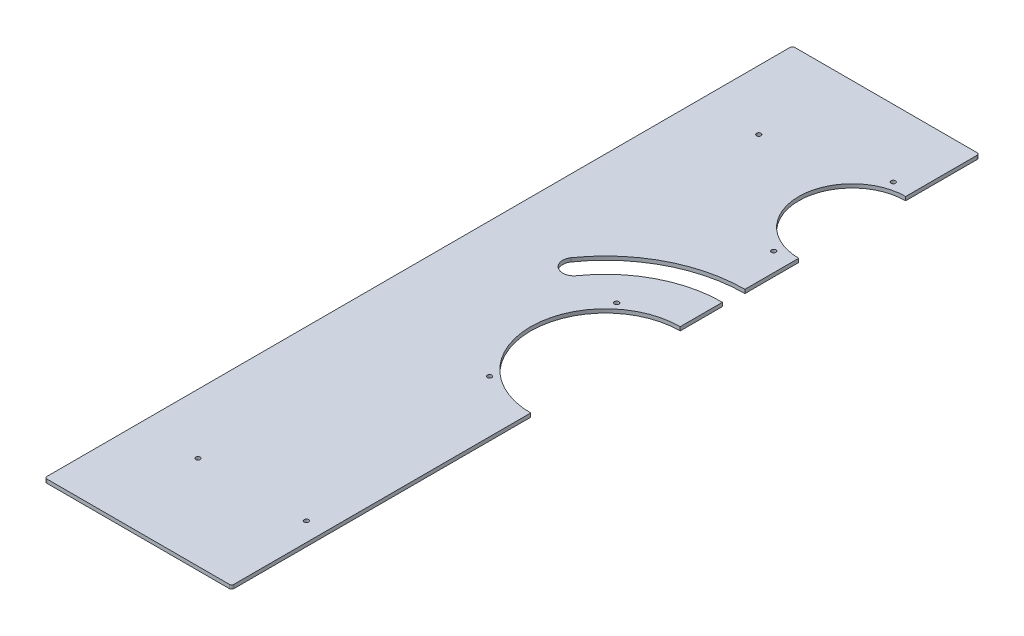
ISO-10303-21;
HEADER;
FILE_DESCRIPTION(('STEP AP214'),'2;1');
FILE_NAME('part.step','',(''),(''),'','','');
FILE_SCHEMA(('AUTOMOTIVE_DESIGN { 1 0 10303 214 1 1 1 1 }'));
ENDSEC;
DATA;
#1=APPLICATION_CONTEXT('core data for automotive mechanical design processes');
#2=APPLICATION_PROTOCOL_DEFINITION('international standard','automotive_design',2000,#1);
#3=PRODUCT_CONTEXT('',#1,'mechanical');
#4=PRODUCT('Part','Part','',(#3));
#5=PRODUCT_RELATED_PRODUCT_CATEGORY('part','',(#4));
#6=PRODUCT_DEFINITION_FORMATION('','',#4);
#7=PRODUCT_DEFINITION_CONTEXT('part definition',#1,'design');
#8=PRODUCT_DEFINITION('design','',#6,#7);
#9=PRODUCT_DEFINITION_SHAPE('','',#8);
#10=(LENGTH_UNIT() NAMED_UNIT(*) SI_UNIT(.MILLI.,.METRE.));
#11=(NAMED_UNIT(*) PLANE_ANGLE_UNIT() SI_UNIT($,.RADIAN.));
#12=(NAMED_UNIT(*) SI_UNIT($,.STERADIAN.) SOLID_ANGLE_UNIT());
#13=UNCERTAINTY_MEASURE_WITH_UNIT(LENGTH_MEASURE(1.E-05),#10,'distance_accuracy_value','');
#14=(GEOMETRIC_REPRESENTATION_CONTEXT(3) GLOBAL_UNCERTAINTY_ASSIGNED_CONTEXT((#13)) GLOBAL_UNIT_ASSIGNED_CONTEXT((#10,
#11,#12)) REPRESENTATION_CONTEXT('',''));
#15=CARTESIAN_POINT('',(0.,0.,0.));
#16=DIRECTION('',(0.,0.,1.));
#17=DIRECTION('',(1.,0.,0.));
#18=AXIS2_PLACEMENT_3D('',#15,#16,#17);
#19=CARTESIAN_POINT('',(125.,5.,500.));
#20=DIRECTION('',(-1.,0.,0.));
#21=DIRECTION('',(0.,0.,1.));
#22=AXIS2_PLACEMENT_3D('',#19,#20,#21);
#23=PLANE('',#22);
#24=DIRECTION('',(0.,0.,-1.));
#25=VECTOR('',#24,1.);
#26=CARTESIAN_POINT('',(125.,0.,500.));
#27=LINE('',#26,#25);
#28=CARTESIAN_POINT('',(125.,0.,-99.9999999999999));
#29=VERTEX_POINT('',#28);
#30=CARTESIAN_POINT('',(125.,0.,-156.5));
#31=VERTEX_POINT('',#30);
#32=EDGE_CURVE('E166',#29,#31,#27,.T.);
#33=ORIENTED_EDGE('',*,*,#32,.T.);
#34=DIRECTION('',(0.,1.,0.));
#35=VECTOR('',#34,1.);
#36=CARTESIAN_POINT('',(125.,-0.00100000000000013,-156.5));
#37=LINE('',#36,#35);
#38=CARTESIAN_POINT('',(125.,5.,-156.5));
#39=VERTEX_POINT('',#38);
#40=EDGE_CURVE('E146',#39,#31,#37,.F.);
#41=ORIENTED_EDGE('',*,*,#40,.F.);
#42=DIRECTION('',(0.,0.,-1.));
#43=VECTOR('',#42,1.);
#44=CARTESIAN_POINT('',(125.,5.,500.));
#45=LINE('',#44,#43);
#46=CARTESIAN_POINT('',(125.,5.,-99.9999999999999));
#47=VERTEX_POINT('',#46);
#48=EDGE_CURVE('E256',#47,#39,#45,.T.);
#49=ORIENTED_EDGE('',*,*,#48,.F.);
#50=DIRECTION('',(0.,1.,0.));
#51=VECTOR('',#50,1.);
#52=CARTESIAN_POINT('',(125.,-0.00100000000000013,-99.9999999999999));
#53=LINE('',#52,#51);
#54=EDGE_CURVE('E171',#29,#47,#53,.T.);
#55=ORIENTED_EDGE('',*,*,#54,.F.);
#56=EDGE_LOOP('',(#33,#41,#49,#55));
#57=FACE_BOUND('',#56,.T.);
#58=ADVANCED_FACE('F34',(#57),#23,.F.);
#59=CARTESIAN_POINT('',(125.,0.,497.));
#60=VERTEX_POINT('',#59);
#61=CARTESIAN_POINT('',(125.,0.,100.));
#62=VERTEX_POINT('',#61);
#63=EDGE_CURVE('E172',#60,#62,#27,.T.);
#64=ORIENTED_EDGE('',*,*,#63,.T.);
#65=DIRECTION('',(0.,1.,0.));
#66=VECTOR('',#65,1.);
#67=CARTESIAN_POINT('',(125.,-0.00100000000000013,100.));
#68=LINE('',#67,#66);
#69=CARTESIAN_POINT('',(125.,5.,100.));
#70=VERTEX_POINT('',#69);
#71=EDGE_CURVE('E243',#70,#62,#68,.F.);
#72=ORIENTED_EDGE('',*,*,#71,.F.);
#73=CARTESIAN_POINT('',(125.,5.,497.));
#74=VERTEX_POINT('',#73);
#75=EDGE_CURVE('E231',#74,#70,#45,.T.);
#76=ORIENTED_EDGE('',*,*,#75,.F.);
#77=DIRECTION('',(0.,-1.,0.));
#78=VECTOR('',#77,1.);
#79=CARTESIAN_POINT('',(125.,5.,497.));
#80=LINE('',#79,#78);
#81=EDGE_CURVE('E42',#74,#60,#80,.T.);
#82=ORIENTED_EDGE('',*,*,#81,.T.);
#83=EDGE_LOOP('',(#64,#72,#76,#82));
#84=FACE_BOUND('',#83,.T.);
#85=ADVANCED_FACE('F228',(#84),#23,.F.);
#86=CARTESIAN_POINT('',(125.,5.,-186.5));
#87=VERTEX_POINT('',#86);
#88=CARTESIAN_POINT('',(125.,5.,-258.5));
#89=VERTEX_POINT('',#88);
#90=EDGE_CURVE('E312',#87,#89,#45,.T.);
#91=ORIENTED_EDGE('',*,*,#90,.F.);
#92=DIRECTION('',(0.,1.,0.));
#93=VECTOR('',#92,1.);
#94=CARTESIAN_POINT('',(125.,-0.00100000000000013,-186.5));
#95=LINE('',#94,#93);
#96=CARTESIAN_POINT('',(125.,0.,-186.5));
#97=VERTEX_POINT('',#96);
#98=EDGE_CURVE('E158',#97,#87,#95,.T.);
#99=ORIENTED_EDGE('',*,*,#98,.F.);
#100=CARTESIAN_POINT('',(125.,0.,-258.5));
#101=VERTEX_POINT('',#100);
#102=EDGE_CURVE('E173',#97,#101,#27,.T.);
#103=ORIENTED_EDGE('',*,*,#102,.T.);
#104=DIRECTION('',(0.,1.,0.));
#105=VECTOR('',#104,1.);
#106=CARTESIAN_POINT('',(125.,-0.00100000000000013,-258.5));
#107=LINE('',#106,#105);
#108=EDGE_CURVE('E57',#89,#101,#107,.F.);
#109=ORIENTED_EDGE('',*,*,#108,.F.);
#110=EDGE_LOOP('',(#91,#99,#103,#109));
#111=FACE_BOUND('',#110,.T.);
#112=ADVANCED_FACE('F295',(#111),#23,.F.);
#113=CARTESIAN_POINT('',(125.,5.,-401.5));
#114=VERTEX_POINT('',#113);
#115=CARTESIAN_POINT('',(125.,5.,-497.));
#116=VERTEX_POINT('',#115);
#117=EDGE_CURVE('E191',#114,#116,#45,.T.);
#118=ORIENTED_EDGE('',*,*,#117,.F.);
#119=DIRECTION('',(0.,1.,0.));
#120=VECTOR('',#119,1.);
#121=CARTESIAN_POINT('',(125.,-0.00100000000000013,-401.5));
#122=LINE('',#121,#120);
#123=CARTESIAN_POINT('',(125.,0.,-401.5));
#124=VERTEX_POINT('',#123);
#125=EDGE_CURVE('E247',#124,#114,#122,.T.);
#126=ORIENTED_EDGE('',*,*,#125,.F.);
#127=CARTESIAN_POINT('',(125.,0.,-497.));
#128=VERTEX_POINT('',#127);
#129=EDGE_CURVE('E177',#124,#128,#27,.T.);
#130=ORIENTED_EDGE('',*,*,#129,.T.);
#131=DIRECTION('',(0.,-1.,0.));
#132=VECTOR('',#131,1.);
#133=CARTESIAN_POINT('',(125.,5.,-497.));
#134=LINE('',#133,#132);
#135=EDGE_CURVE('E11',#128,#116,#134,.F.);
#136=ORIENTED_EDGE('',*,*,#135,.T.);
#137=EDGE_LOOP('',(#118,#126,#130,#136));
#138=FACE_BOUND('',#137,.T.);
#139=ADVANCED_FACE('F291',(#138),#23,.F.);
#140=CARTESIAN_POINT('',(-125.,5.,-500.));
#141=DIRECTION('',(0.,0.,1.));
#142=DIRECTION('',(1.,0.,0.));
#143=AXIS2_PLACEMENT_3D('',#140,#141,#142);
#144=PLANE('',#143);
#145=DIRECTION('',(-1.,0.,0.));
#146=VECTOR('',#145,1.);
#147=CARTESIAN_POINT('',(-125.,0.,-500.));
#148=LINE('',#147,#146);
#149=CARTESIAN_POINT('',(122.,0.,-500.));
#150=VERTEX_POINT('',#149);
#151=CARTESIAN_POINT('',(-122.,0.,-500.));
#152=VERTEX_POINT('',#151);
#153=EDGE_CURVE('E176',#150,#152,#148,.T.);
#154=ORIENTED_EDGE('',*,*,#153,.T.);
#155=DIRECTION('',(0.,-1.,0.));
#156=VECTOR('',#155,1.);
#157=CARTESIAN_POINT('',(-122.,5.,-500.));
#158=LINE('',#157,#156);
#159=CARTESIAN_POINT('',(-122.,5.,-500.));
#160=VERTEX_POINT('',#159);
#161=EDGE_CURVE('E222',#152,#160,#158,.F.);
#162=ORIENTED_EDGE('',*,*,#161,.T.);
#163=DIRECTION('',(-1.,0.,0.));
#164=VECTOR('',#163,1.);
#165=CARTESIAN_POINT('',(-125.,5.,-500.));
#166=LINE('',#165,#164);
#167=CARTESIAN_POINT('',(122.,5.,-500.));
#168=VERTEX_POINT('',#167);
#169=EDGE_CURVE('E255',#168,#160,#166,.T.);
#170=ORIENTED_EDGE('',*,*,#169,.F.);
#171=DIRECTION('',(0.,-1.,0.));
#172=VECTOR('',#171,1.);
#173=CARTESIAN_POINT('',(122.,5.,-500.));
#174=LINE('',#173,#172);
#175=EDGE_CURVE('E219',#168,#150,#174,.T.);
#176=ORIENTED_EDGE('',*,*,#175,.T.);
#177=EDGE_LOOP('',(#154,#162,#170,#176));
#178=FACE_BOUND('',#177,.T.);
#179=ADVANCED_FACE('F298',(#178),#144,.F.);
#180=CARTESIAN_POINT('',(-125.,5.,500.));
#181=DIRECTION('',(1.,0.,0.));
#182=DIRECTION('',(0.,0.,-1.));
#183=AXIS2_PLACEMENT_3D('',#180,#181,#182);
#184=PLANE('',#183);
#185=DIRECTION('',(0.,0.,1.));
#186=VECTOR('',#185,1.);
#187=CARTESIAN_POINT('',(-125.,0.,500.));
#188=LINE('',#187,#186);
#189=CARTESIAN_POINT('',(-125.,0.,-497.));
#190=VERTEX_POINT('',#189);
#191=CARTESIAN_POINT('',(-125.,0.,497.));
#192=VERTEX_POINT('',#191);
#193=EDGE_CURVE('E185',#190,#192,#188,.T.);
#194=ORIENTED_EDGE('',*,*,#193,.T.);
#195=DIRECTION('',(0.,-1.,0.));
#196=VECTOR('',#195,1.);
#197=CARTESIAN_POINT('',(-125.,5.,497.));
#198=LINE('',#197,#196);
#199=CARTESIAN_POINT('',(-125.,5.,497.));
#200=VERTEX_POINT('',#199);
#201=EDGE_CURVE('E209',#192,#200,#198,.F.);
#202=ORIENTED_EDGE('',*,*,#201,.T.);
#203=DIRECTION('',(0.,0.,1.));
#204=VECTOR('',#203,1.);
#205=CARTESIAN_POINT('',(-125.,5.,500.));
#206=LINE('',#205,#204);
#207=CARTESIAN_POINT('',(-125.,5.,-497.));
#208=VERTEX_POINT('',#207);
#209=EDGE_CURVE('E258',#208,#200,#206,.T.);
#210=ORIENTED_EDGE('',*,*,#209,.F.);
#211=DIRECTION('',(0.,-1.,0.));
#212=VECTOR('',#211,1.);
#213=CARTESIAN_POINT('',(-125.,5.,-497.));
#214=LINE('',#213,#212);
#215=EDGE_CURVE('E206',#208,#190,#214,.T.);
#216=ORIENTED_EDGE('',*,*,#215,.T.);
#217=EDGE_LOOP('',(#194,#202,#210,#216));
#218=FACE_BOUND('',#217,.T.);
#219=ADVANCED_FACE('F274',(#218),#184,.F.);
#220=CARTESIAN_POINT('',(-125.,5.,500.));
#221=DIRECTION('',(0.,0.,-1.));
#222=DIRECTION('',(-1.,0.,0.));
#223=AXIS2_PLACEMENT_3D('',#220,#221,#222);
#224=PLANE('',#223);
#225=DIRECTION('',(1.,0.,0.));
#226=VECTOR('',#225,1.);
#227=CARTESIAN_POINT('',(-125.,5.,500.));
#228=LINE('',#227,#226);
#229=CARTESIAN_POINT('',(-122.,5.,500.));
#230=VERTEX_POINT('',#229);
#231=CARTESIAN_POINT('',(122.,5.,500.));
#232=VERTEX_POINT('',#231);
#233=EDGE_CURVE('E181',#230,#232,#228,.T.);
#234=ORIENTED_EDGE('',*,*,#233,.F.);
#235=DIRECTION('',(0.,-1.,0.));
#236=VECTOR('',#235,1.);
#237=CARTESIAN_POINT('',(-122.,5.,500.));
#238=LINE('',#237,#236);
#239=CARTESIAN_POINT('',(-122.,0.,500.));
#240=VERTEX_POINT('',#239);
#241=EDGE_CURVE('E194',#230,#240,#238,.T.);
#242=ORIENTED_EDGE('',*,*,#241,.T.);
#243=DIRECTION('',(1.,0.,0.));
#244=VECTOR('',#243,1.);
#245=CARTESIAN_POINT('',(-125.,0.,500.));
#246=LINE('',#245,#244);
#247=CARTESIAN_POINT('',(122.,0.,500.));
#248=VERTEX_POINT('',#247);
#249=EDGE_CURVE('E188',#240,#248,#246,.T.);
#250=ORIENTED_EDGE('',*,*,#249,.T.);
#251=DIRECTION('',(0.,-1.,0.));
#252=VECTOR('',#251,1.);
#253=CARTESIAN_POINT('',(122.,5.,500.));
#254=LINE('',#253,#252);
#255=EDGE_CURVE('E192',#248,#232,#254,.F.);
#256=ORIENTED_EDGE('',*,*,#255,.T.);
#257=EDGE_LOOP('',(#234,#242,#250,#256));
#258=FACE_BOUND('',#257,.T.);
#259=ADVANCED_FACE('F269',(#258),#224,.F.);
#260=CARTESIAN_POINT('',(0.,5.,0.));
#261=DIRECTION('',(0.,-1.,0.));
#262=DIRECTION('',(0.,0.,-1.));
#263=AXIS2_PLACEMENT_3D('',#260,#261,#262);
#264=PLANE('',#263);
#265=CARTESIAN_POINT('',(100.,5.,-250.));
#266=DIRECTION('',(0.,1.,0.));
#267=DIRECTION('',(0.,0.,-1.));
#268=AXIS2_PLACEMENT_3D('',#265,#266,#267);
#269=CIRCLE('',#268,3.00000000000001);
#270=CARTESIAN_POINT('',(100.,5.,-253.));
#271=VERTEX_POINT('',#270);
#272=EDGE_CURVE('E339',#271,#271,#269,.T.);
#273=ORIENTED_EDGE('',*,*,#272,.F.);
#274=EDGE_LOOP('',(#273));
#275=FACE_BOUND('',#274,.T.);
#276=CARTESIAN_POINT('',(100.,5.,-410.));
#277=DIRECTION('',(0.,1.,0.));
#278=DIRECTION('',(0.,0.,1.));
#279=AXIS2_PLACEMENT_3D('',#276,#277,#278);
#280=CIRCLE('',#279,3.00000000000001);
#281=CARTESIAN_POINT('',(100.,5.,-407.));
#282=VERTEX_POINT('',#281);
#283=EDGE_CURVE('E346',#282,#282,#280,.T.);
#284=ORIENTED_EDGE('',*,*,#283,.F.);
#285=EDGE_LOOP('',(#284));
#286=FACE_BOUND('',#285,.T.);
#287=CARTESIAN_POINT('',(55.,5.,-85.));
#288=DIRECTION('',(0.,1.,0.));
#289=DIRECTION('',(0.,0.,-1.));
#290=AXIS2_PLACEMENT_3D('',#287,#288,#289);
#291=CIRCLE('',#290,3.);
#292=CARTESIAN_POINT('',(55.,5.,-88.));
#293=VERTEX_POINT('',#292);
#294=EDGE_CURVE('E328',#293,#293,#291,.T.);
#295=ORIENTED_EDGE('',*,*,#294,.F.);
#296=EDGE_LOOP('',(#295));
#297=FACE_BOUND('',#296,.T.);
#298=CARTESIAN_POINT('',(-45.,5.,375.));
#299=DIRECTION('',(0.,1.,0.));
#300=DIRECTION('',(0.,0.,1.));
#301=AXIS2_PLACEMENT_3D('',#298,#299,#300);
#302=CIRCLE('',#301,3.);
#303=CARTESIAN_POINT('',(-45.,5.,378.));
#304=VERTEX_POINT('',#303);
#305=EDGE_CURVE('E241',#304,#304,#302,.T.);
#306=ORIENTED_EDGE('',*,*,#305,.F.);
#307=EDGE_LOOP('',(#306));
#308=FACE_BOUND('',#307,.T.);
#309=CARTESIAN_POINT('',(-45.,5.,-375.));
#310=DIRECTION('',(0.,1.,0.));
#311=DIRECTION('',(0.,0.,-1.));
#312=AXIS2_PLACEMENT_3D('',#309,#310,#311);
#313=CIRCLE('',#312,3.);
#314=CARTESIAN_POINT('',(-45.,5.,-378.));
#315=VERTEX_POINT('',#314);
#316=EDGE_CURVE('E319',#315,#315,#313,.T.);
#317=ORIENTED_EDGE('',*,*,#316,.F.);
#318=EDGE_LOOP('',(#317));
#319=FACE_BOUND('',#318,.T.);
#320=CARTESIAN_POINT('',(55.,5.,85.));
#321=DIRECTION('',(0.,1.,0.));
#322=DIRECTION('',(0.,0.,1.));
#323=AXIS2_PLACEMENT_3D('',#320,#321,#322);
#324=CIRCLE('',#323,3.);
#325=CARTESIAN_POINT('',(55.,5.,88.));
#326=VERTEX_POINT('',#325);
#327=EDGE_CURVE('E327',#326,#326,#324,.T.);
#328=ORIENTED_EDGE('',*,*,#327,.F.);
#329=EDGE_LOOP('',(#328));
#330=FACE_BOUND('',#329,.T.);
#331=CARTESIAN_POINT('',(100.,5.,375.));
#332=DIRECTION('',(0.,1.,0.));
#333=DIRECTION('',(0.,0.,1.));
#334=AXIS2_PLACEMENT_3D('',#331,#332,#333);
#335=CIRCLE('',#334,3.00000000000001);
#336=CARTESIAN_POINT('',(100.,5.,378.));
#337=VERTEX_POINT('',#336);
#338=EDGE_CURVE('E340',#337,#337,#335,.T.);
#339=ORIENTED_EDGE('',*,*,#338,.F.);
#340=EDGE_LOOP('',(#339));
#341=FACE_BOUND('',#340,.T.);
#342=ORIENTED_EDGE('',*,*,#48,.T.);
#343=CARTESIAN_POINT('',(125.,5.,0.));
#344=DIRECTION('',(0.,-1.,0.));
#345=DIRECTION('',(0.,0.,1.));
#346=AXIS2_PLACEMENT_3D('',#343,#344,#345);
#347=CIRCLE('',#346,156.5);
#348=CARTESIAN_POINT('',(-3.19729493122746,5.,-89.7647122889385));
#349=VERTEX_POINT('',#348);
#350=EDGE_CURVE('E152',#349,#39,#347,.T.);
#351=ORIENTED_EDGE('',*,*,#350,.F.);
#352=CARTESIAN_POINT('',(-15.4845755955623,5.,-98.3683588342042));
#353=DIRECTION('',(0.,1.,0.));
#354=DIRECTION('',(0.,0.,1.));
#355=AXIS2_PLACEMENT_3D('',#352,#353,#354);
#356=CIRCLE('',#355,15.);
#357=CARTESIAN_POINT('',(-27.7718562598971,5.,-106.97200537947));
#358=VERTEX_POINT('',#357);
#359=EDGE_CURVE('E360',#358,#349,#356,.T.);
#360=ORIENTED_EDGE('',*,*,#359,.F.);
#361=CARTESIAN_POINT('',(125.,5.,0.));
#362=DIRECTION('',(0.,1.,0.));
#363=DIRECTION('',(0.,0.,1.));
#364=AXIS2_PLACEMENT_3D('',#361,#362,#363);
#365=CIRCLE('',#364,186.5);
#366=EDGE_CURVE('E168',#87,#358,#365,.T.);
#367=ORIENTED_EDGE('',*,*,#366,.F.);
#368=ORIENTED_EDGE('',*,*,#90,.T.);
#369=CARTESIAN_POINT('',(125.,5.,-330.));
#370=DIRECTION('',(0.,1.,0.));
#371=DIRECTION('',(0.,0.,1.));
#372=AXIS2_PLACEMENT_3D('',#369,#370,#371);
#373=CIRCLE('',#372,71.5);
#374=EDGE_CURVE('E250',#114,#89,#373,.T.);
#375=ORIENTED_EDGE('',*,*,#374,.F.);
#376=ORIENTED_EDGE('',*,*,#117,.T.);
#377=CARTESIAN_POINT('',(122.,5.,-497.));
#378=DIRECTION('',(0.,-1.,0.));
#379=DIRECTION('',(0.,0.,-1.));
#380=AXIS2_PLACEMENT_3D('',#377,#378,#379);
#381=CIRCLE('',#380,3.);
#382=EDGE_CURVE('E213',#116,#168,#381,.F.);
#383=ORIENTED_EDGE('',*,*,#382,.T.);
#384=ORIENTED_EDGE('',*,*,#169,.T.);
#385=CARTESIAN_POINT('',(-122.,5.,-497.));
#386=DIRECTION('',(0.,-1.,0.));
#387=DIRECTION('',(0.,0.,-1.));
#388=AXIS2_PLACEMENT_3D('',#385,#386,#387);
#389=CIRCLE('',#388,3.);
#390=EDGE_CURVE('E215',#160,#208,#389,.F.);
#391=ORIENTED_EDGE('',*,*,#390,.T.);
#392=ORIENTED_EDGE('',*,*,#209,.T.);
#393=CARTESIAN_POINT('',(-122.,5.,497.));
#394=DIRECTION('',(0.,-1.,0.));
#395=DIRECTION('',(0.,0.,-1.));
#396=AXIS2_PLACEMENT_3D('',#393,#394,#395);
#397=CIRCLE('',#396,3.);
#398=EDGE_CURVE('E217',#200,#230,#397,.F.);
#399=ORIENTED_EDGE('',*,*,#398,.T.);
#400=ORIENTED_EDGE('',*,*,#233,.T.);
#401=CARTESIAN_POINT('',(122.,5.,497.));
#402=DIRECTION('',(0.,-1.,0.));
#403=DIRECTION('',(0.,0.,-1.));
#404=AXIS2_PLACEMENT_3D('',#401,#402,#403);
#405=CIRCLE('',#404,3.);
#406=EDGE_CURVE('E211',#232,#74,#405,.F.);
#407=ORIENTED_EDGE('',*,*,#406,.T.);
#408=ORIENTED_EDGE('',*,*,#75,.T.);
#409=CARTESIAN_POINT('',(125.,5.,1.11022302462516E-13));
#410=DIRECTION('',(0.,1.,0.));
#411=DIRECTION('',(0.,0.,1.));
#412=AXIS2_PLACEMENT_3D('',#409,#410,#411);
#413=CIRCLE('',#412,100.);
#414=EDGE_CURVE('E238',#47,#70,#413,.T.);
#415=ORIENTED_EDGE('',*,*,#414,.F.);
#416=EDGE_LOOP('',(#342,#351,#360,#367,#368,#375,#376,#383,#384,#391,#392,#399,#400,#407,#408,#415));
#417=FACE_BOUND('',#416,.T.);
#418=ADVANCED_FACE('F265',(#275,#286,#297,#308,#319,#330,#341,#417),#264,.F.);
#419=CARTESIAN_POINT('',(0.,0.,0.));
#420=DIRECTION('',(0.,-1.,0.));
#421=DIRECTION('',(0.,0.,-1.));
#422=AXIS2_PLACEMENT_3D('',#419,#420,#421);
#423=PLANE('',#422);
#424=CARTESIAN_POINT('',(100.,0.,-250.));
#425=DIRECTION('',(0.,-1.,0.));
#426=DIRECTION('',(0.,0.,-1.));
#427=AXIS2_PLACEMENT_3D('',#424,#425,#426);
#428=CIRCLE('',#427,3.00000000000001);
#429=CARTESIAN_POINT('',(100.,0.,-253.));
#430=VERTEX_POINT('',#429);
#431=EDGE_CURVE('E336',#430,#430,#428,.F.);
#432=ORIENTED_EDGE('',*,*,#431,.T.);
#433=EDGE_LOOP('',(#432));
#434=FACE_BOUND('',#433,.T.);
#435=CARTESIAN_POINT('',(100.,0.,-410.));
#436=DIRECTION('',(0.,-1.,0.));
#437=DIRECTION('',(0.,0.,-1.));
#438=AXIS2_PLACEMENT_3D('',#435,#436,#437);
#439=CIRCLE('',#438,3.00000000000001);
#440=CARTESIAN_POINT('',(100.,0.,-413.));
#441=VERTEX_POINT('',#440);
#442=EDGE_CURVE('E343',#441,#441,#439,.F.);
#443=ORIENTED_EDGE('',*,*,#442,.T.);
#444=EDGE_LOOP('',(#443));
#445=FACE_BOUND('',#444,.T.);
#446=CARTESIAN_POINT('',(55.,0.,-85.));
#447=DIRECTION('',(0.,-1.,0.));
#448=DIRECTION('',(0.,0.,-1.));
#449=AXIS2_PLACEMENT_3D('',#446,#447,#448);
#450=CIRCLE('',#449,3.);
#451=CARTESIAN_POINT('',(55.,0.,-88.));
#452=VERTEX_POINT('',#451);
#453=EDGE_CURVE('E349',#452,#452,#450,.F.);
#454=ORIENTED_EDGE('',*,*,#453,.T.);
#455=EDGE_LOOP('',(#454));
#456=FACE_BOUND('',#455,.T.);
#457=CARTESIAN_POINT('',(125.,0.,0.));
#458=DIRECTION('',(0.,-1.,0.));
#459=DIRECTION('',(0.,0.,-1.));
#460=AXIS2_PLACEMENT_3D('',#457,#458,#459);
#461=CIRCLE('',#460,156.5);
#462=CARTESIAN_POINT('',(-3.19729493122746,0.,-89.7647122889385));
#463=VERTEX_POINT('',#462);
#464=EDGE_CURVE('E149',#463,#31,#461,.T.);
#465=ORIENTED_EDGE('',*,*,#464,.T.);
#466=ORIENTED_EDGE('',*,*,#32,.F.);
#467=CARTESIAN_POINT('',(125.,0.,1.11022302462516E-13));
#468=DIRECTION('',(0.,-1.,0.));
#469=DIRECTION('',(0.,0.,-1.));
#470=AXIS2_PLACEMENT_3D('',#467,#468,#469);
#471=CIRCLE('',#470,100.);
#472=EDGE_CURVE('E235',#29,#62,#471,.F.);
#473=ORIENTED_EDGE('',*,*,#472,.T.);
#474=ORIENTED_EDGE('',*,*,#63,.F.);
#475=CARTESIAN_POINT('',(122.,0.,497.));
#476=DIRECTION('',(0.,-1.,0.));
#477=DIRECTION('',(0.,0.,-1.));
#478=AXIS2_PLACEMENT_3D('',#475,#476,#477);
#479=CIRCLE('',#478,3.);
#480=EDGE_CURVE('E197',#60,#248,#479,.T.);
#481=ORIENTED_EDGE('',*,*,#480,.T.);
#482=ORIENTED_EDGE('',*,*,#249,.F.);
#483=CARTESIAN_POINT('',(-122.,0.,497.));
#484=DIRECTION('',(0.,-1.,0.));
#485=DIRECTION('',(0.,0.,-1.));
#486=AXIS2_PLACEMENT_3D('',#483,#484,#485);
#487=CIRCLE('',#486,3.);
#488=EDGE_CURVE('E204',#240,#192,#487,.T.);
#489=ORIENTED_EDGE('',*,*,#488,.T.);
#490=ORIENTED_EDGE('',*,*,#193,.F.);
#491=CARTESIAN_POINT('',(-122.,0.,-497.));
#492=DIRECTION('',(0.,-1.,0.));
#493=DIRECTION('',(0.,0.,-1.));
#494=AXIS2_PLACEMENT_3D('',#491,#492,#493);
#495=CIRCLE('',#494,3.);
#496=EDGE_CURVE('E202',#190,#152,#495,.T.);
#497=ORIENTED_EDGE('',*,*,#496,.T.);
#498=ORIENTED_EDGE('',*,*,#153,.F.);
#499=CARTESIAN_POINT('',(122.,0.,-497.));
#500=DIRECTION('',(0.,-1.,0.));
#501=DIRECTION('',(0.,0.,-1.));
#502=AXIS2_PLACEMENT_3D('',#499,#500,#501);
#503=CIRCLE('',#502,3.);
#504=EDGE_CURVE('E199',#150,#128,#503,.T.);
#505=ORIENTED_EDGE('',*,*,#504,.T.);
#506=ORIENTED_EDGE('',*,*,#129,.F.);
#507=CARTESIAN_POINT('',(125.,0.,-330.));
#508=DIRECTION('',(0.,-1.,0.));
#509=DIRECTION('',(0.,0.,-1.));
#510=AXIS2_PLACEMENT_3D('',#507,#508,#509);
#511=CIRCLE('',#510,71.5);
#512=EDGE_CURVE('E252',#124,#101,#511,.F.);
#513=ORIENTED_EDGE('',*,*,#512,.T.);
#514=ORIENTED_EDGE('',*,*,#102,.F.);
#515=CARTESIAN_POINT('',(125.,0.,0.));
#516=DIRECTION('',(0.,-1.,0.));
#517=DIRECTION('',(0.,0.,-1.));
#518=AXIS2_PLACEMENT_3D('',#515,#516,#517);
#519=CIRCLE('',#518,186.5);
#520=CARTESIAN_POINT('',(-27.7718562598971,0.,-106.97200537947));
#521=VERTEX_POINT('',#520);
#522=EDGE_CURVE('E352',#97,#521,#519,.F.);
#523=ORIENTED_EDGE('',*,*,#522,.T.);
#524=CARTESIAN_POINT('',(-15.4845755955623,0.,-98.3683588342042));
#525=DIRECTION('',(0.,-1.,0.));
#526=DIRECTION('',(0.,0.,-1.));
#527=AXIS2_PLACEMENT_3D('',#524,#525,#526);
#528=CIRCLE('',#527,15.);
#529=EDGE_CURVE('E157',#521,#463,#528,.F.);
#530=ORIENTED_EDGE('',*,*,#529,.T.);
#531=EDGE_LOOP('',(#465,#466,#473,#474,#481,#482,#489,#490,#497,#498,#505,#506,#513,#514,#523,#530));
#532=FACE_BOUND('',#531,.T.);
#533=CARTESIAN_POINT('',(-45.,0.,375.));
#534=DIRECTION('',(0.,-1.,0.));
#535=DIRECTION('',(0.,0.,-1.));
#536=AXIS2_PLACEMENT_3D('',#533,#534,#535);
#537=CIRCLE('',#536,3.);
#538=CARTESIAN_POINT('',(-45.,0.,372.));
#539=VERTEX_POINT('',#538);
#540=EDGE_CURVE('E237',#539,#539,#537,.F.);
#541=ORIENTED_EDGE('',*,*,#540,.T.);
#542=EDGE_LOOP('',(#541));
#543=FACE_BOUND('',#542,.T.);
#544=CARTESIAN_POINT('',(-45.,0.,-375.));
#545=DIRECTION('',(0.,-1.,0.));
#546=DIRECTION('',(0.,0.,-1.));
#547=AXIS2_PLACEMENT_3D('',#544,#545,#546);
#548=CIRCLE('',#547,3.);
#549=CARTESIAN_POINT('',(-45.,0.,-378.));
#550=VERTEX_POINT('',#549);
#551=EDGE_CURVE('E331',#550,#550,#548,.F.);
#552=ORIENTED_EDGE('',*,*,#551,.T.);
#553=EDGE_LOOP('',(#552));
#554=FACE_BOUND('',#553,.T.);
#555=CARTESIAN_POINT('',(55.,0.,85.));
#556=DIRECTION('',(0.,-1.,0.));
#557=DIRECTION('',(0.,0.,-1.));
#558=AXIS2_PLACEMENT_3D('',#555,#556,#557);
#559=CIRCLE('',#558,3.);
#560=CARTESIAN_POINT('',(55.,0.,82.));
#561=VERTEX_POINT('',#560);
#562=EDGE_CURVE('E324',#561,#561,#559,.F.);
#563=ORIENTED_EDGE('',*,*,#562,.T.);
#564=EDGE_LOOP('',(#563));
#565=FACE_BOUND('',#564,.T.);
#566=CARTESIAN_POINT('',(100.,0.,375.));
#567=DIRECTION('',(0.,-1.,0.));
#568=DIRECTION('',(0.,0.,-1.));
#569=AXIS2_PLACEMENT_3D('',#566,#567,#568);
#570=CIRCLE('',#569,3.00000000000001);
#571=CARTESIAN_POINT('',(100.,0.,372.));
#572=VERTEX_POINT('',#571);
#573=EDGE_CURVE('E366',#572,#572,#570,.F.);
#574=ORIENTED_EDGE('',*,*,#573,.T.);
#575=EDGE_LOOP('',(#574));
#576=FACE_BOUND('',#575,.T.);
#577=ADVANCED_FACE('F163',(#434,#445,#456,#532,#543,#554,#565,#576),#423,.T.);
#578=CARTESIAN_POINT('',(-122.,5.,497.));
#579=DIRECTION('',(0.,-1.,0.));
#580=DIRECTION('',(0.,0.,-1.));
#581=AXIS2_PLACEMENT_3D('',#578,#579,#580);
#582=CYLINDRICAL_SURFACE('',#581,3.);
#583=ORIENTED_EDGE('',*,*,#398,.F.);
#584=ORIENTED_EDGE('',*,*,#201,.F.);
#585=ORIENTED_EDGE('',*,*,#488,.F.);
#586=ORIENTED_EDGE('',*,*,#241,.F.);
#587=EDGE_LOOP('',(#583,#584,#585,#586));
#588=FACE_BOUND('',#587,.T.);
#589=ADVANCED_FACE('F276',(#588),#582,.T.);
#590=CARTESIAN_POINT('',(-122.,5.,-497.));
#591=DIRECTION('',(0.,-1.,0.));
#592=DIRECTION('',(0.,0.,-1.));
#593=AXIS2_PLACEMENT_3D('',#590,#591,#592);
#594=CYLINDRICAL_SURFACE('',#593,3.);
#595=ORIENTED_EDGE('',*,*,#390,.F.);
#596=ORIENTED_EDGE('',*,*,#161,.F.);
#597=ORIENTED_EDGE('',*,*,#496,.F.);
#598=ORIENTED_EDGE('',*,*,#215,.F.);
#599=EDGE_LOOP('',(#595,#596,#597,#598));
#600=FACE_BOUND('',#599,.T.);
#601=ADVANCED_FACE('F278',(#600),#594,.T.);
#602=CARTESIAN_POINT('',(122.,5.,-497.));
#603=DIRECTION('',(0.,-1.,0.));
#604=DIRECTION('',(0.,0.,-1.));
#605=AXIS2_PLACEMENT_3D('',#602,#603,#604);
#606=CYLINDRICAL_SURFACE('',#605,3.);
#607=ORIENTED_EDGE('',*,*,#382,.F.);
#608=ORIENTED_EDGE('',*,*,#135,.F.);
#609=ORIENTED_EDGE('',*,*,#504,.F.);
#610=ORIENTED_EDGE('',*,*,#175,.F.);
#611=EDGE_LOOP('',(#607,#608,#609,#610));
#612=FACE_BOUND('',#611,.T.);
#613=ADVANCED_FACE('F284',(#612),#606,.T.);
#614=CARTESIAN_POINT('',(122.,5.,497.));
#615=DIRECTION('',(0.,-1.,0.));
#616=DIRECTION('',(0.,0.,-1.));
#617=AXIS2_PLACEMENT_3D('',#614,#615,#616);
#618=CYLINDRICAL_SURFACE('',#617,3.);
#619=ORIENTED_EDGE('',*,*,#406,.F.);
#620=ORIENTED_EDGE('',*,*,#255,.F.);
#621=ORIENTED_EDGE('',*,*,#480,.F.);
#622=ORIENTED_EDGE('',*,*,#81,.F.);
#623=EDGE_LOOP('',(#619,#620,#621,#622));
#624=FACE_BOUND('',#623,.T.);
#625=ADVANCED_FACE('F36',(#624),#618,.T.);
#626=CARTESIAN_POINT('',(125.,-0.00100000000000013,-330.));
#627=DIRECTION('',(0.,1.,0.));
#628=DIRECTION('',(0.,0.,1.));
#629=AXIS2_PLACEMENT_3D('',#626,#627,#628);
#630=CYLINDRICAL_SURFACE('',#629,71.5);
#631=ORIENTED_EDGE('',*,*,#108,.T.);
#632=ORIENTED_EDGE('',*,*,#512,.F.);
#633=ORIENTED_EDGE('',*,*,#125,.T.);
#634=ORIENTED_EDGE('',*,*,#374,.T.);
#635=EDGE_LOOP('',(#631,#632,#633,#634));
#636=FACE_BOUND('',#635,.T.);
#637=ADVANCED_FACE('F384',(#636),#630,.F.);
#638=CARTESIAN_POINT('',(100.,-0.00100000000000013,375.));
#639=DIRECTION('',(0.,1.,0.));
#640=DIRECTION('',(0.,0.,1.));
#641=AXIS2_PLACEMENT_3D('',#638,#639,#640);
#642=CYLINDRICAL_SURFACE('',#641,3.00000000000001);
#643=ORIENTED_EDGE('',*,*,#573,.F.);
#644=EDGE_LOOP('',(#643));
#645=FACE_BOUND('',#644,.T.);
#646=ORIENTED_EDGE('',*,*,#338,.T.);
#647=EDGE_LOOP('',(#646));
#648=FACE_BOUND('',#647,.T.);
#649=ADVANCED_FACE('F372',(#645,#648),#642,.F.);
#650=CARTESIAN_POINT('',(55.,-0.00100000000000013,85.));
#651=DIRECTION('',(0.,1.,0.));
#652=DIRECTION('',(0.,0.,1.));
#653=AXIS2_PLACEMENT_3D('',#650,#651,#652);
#654=CYLINDRICAL_SURFACE('',#653,3.);
#655=ORIENTED_EDGE('',*,*,#562,.F.);
#656=EDGE_LOOP('',(#655));
#657=FACE_BOUND('',#656,.T.);
#658=ORIENTED_EDGE('',*,*,#327,.T.);
#659=EDGE_LOOP('',(#658));
#660=FACE_BOUND('',#659,.T.);
#661=ADVANCED_FACE('F468',(#657,#660),#654,.F.);
#662=CARTESIAN_POINT('',(-45.,-0.00100000000000013,-375.));
#663=DIRECTION('',(0.,1.,0.));
#664=DIRECTION('',(0.,0.,1.));
#665=AXIS2_PLACEMENT_3D('',#662,#663,#664);
#666=CYLINDRICAL_SURFACE('',#665,3.);
#667=ORIENTED_EDGE('',*,*,#551,.F.);
#668=EDGE_LOOP('',(#667));
#669=FACE_BOUND('',#668,.T.);
#670=ORIENTED_EDGE('',*,*,#316,.T.);
#671=EDGE_LOOP('',(#670));
#672=FACE_BOUND('',#671,.T.);
#673=ADVANCED_FACE('F478',(#669,#672),#666,.F.);
#674=CARTESIAN_POINT('',(125.,-0.00100000000000013,1.11022302462516E-13));
#675=DIRECTION('',(0.,1.,0.));
#676=DIRECTION('',(0.,0.,1.));
#677=AXIS2_PLACEMENT_3D('',#674,#675,#676);
#678=CYLINDRICAL_SURFACE('',#677,100.);
#679=ORIENTED_EDGE('',*,*,#71,.T.);
#680=ORIENTED_EDGE('',*,*,#472,.F.);
#681=ORIENTED_EDGE('',*,*,#54,.T.);
#682=ORIENTED_EDGE('',*,*,#414,.T.);
#683=EDGE_LOOP('',(#679,#680,#681,#682));
#684=FACE_BOUND('',#683,.T.);
#685=ADVANCED_FACE('F318',(#684),#678,.F.);
#686=CARTESIAN_POINT('',(-45.,-0.00100000000000013,375.));
#687=DIRECTION('',(0.,1.,0.));
#688=DIRECTION('',(0.,0.,1.));
#689=AXIS2_PLACEMENT_3D('',#686,#687,#688);
#690=CYLINDRICAL_SURFACE('',#689,3.);
#691=ORIENTED_EDGE('',*,*,#540,.F.);
#692=EDGE_LOOP('',(#691));
#693=FACE_BOUND('',#692,.T.);
#694=ORIENTED_EDGE('',*,*,#305,.T.);
#695=EDGE_LOOP('',(#694));
#696=FACE_BOUND('',#695,.T.);
#697=ADVANCED_FACE('F497',(#693,#696),#690,.F.);
#698=CARTESIAN_POINT('',(125.,-0.00100000000000013,0.));
#699=DIRECTION('',(0.,1.,0.));
#700=DIRECTION('',(0.,0.,1.));
#701=AXIS2_PLACEMENT_3D('',#698,#699,#700);
#702=CYLINDRICAL_SURFACE('',#701,156.5);
#703=DIRECTION('',(0.,1.,0.));
#704=VECTOR('',#703,1.);
#705=CARTESIAN_POINT('',(-3.19729493122746,-0.00100000000000013,-89.7647122889385));
#706=LINE('',#705,#704);
#707=EDGE_CURVE('E356',#463,#349,#706,.T.);
#708=ORIENTED_EDGE('',*,*,#707,.T.);
#709=ORIENTED_EDGE('',*,*,#350,.T.);
#710=ORIENTED_EDGE('',*,*,#40,.T.);
#711=ORIENTED_EDGE('',*,*,#464,.F.);
#712=EDGE_LOOP('',(#708,#709,#710,#711));
#713=FACE_BOUND('',#712,.T.);
#714=ADVANCED_FACE('F148',(#713),#702,.T.);
#715=CARTESIAN_POINT('',(-15.4845755955623,-0.00100000000000013,-98.3683588342042));
#716=DIRECTION('',(0.,1.,0.));
#717=DIRECTION('',(0.,0.,1.));
#718=AXIS2_PLACEMENT_3D('',#715,#716,#717);
#719=CYLINDRICAL_SURFACE('',#718,15.);
#720=DIRECTION('',(0.,1.,0.));
#721=VECTOR('',#720,1.);
#722=CARTESIAN_POINT('',(-27.7718562598971,-0.00100000000000013,-106.97200537947));
#723=LINE('',#722,#721);
#724=EDGE_CURVE('E49',#521,#358,#723,.T.);
#725=ORIENTED_EDGE('',*,*,#724,.T.);
#726=ORIENTED_EDGE('',*,*,#359,.T.);
#727=ORIENTED_EDGE('',*,*,#707,.F.);
#728=ORIENTED_EDGE('',*,*,#529,.F.);
#729=EDGE_LOOP('',(#725,#726,#727,#728));
#730=FACE_BOUND('',#729,.T.);
#731=ADVANCED_FACE('F514',(#730),#719,.F.);
#732=CARTESIAN_POINT('',(125.,-0.00100000000000013,0.));
#733=DIRECTION('',(0.,1.,0.));
#734=DIRECTION('',(0.,0.,1.));
#735=AXIS2_PLACEMENT_3D('',#732,#733,#734);
#736=CYLINDRICAL_SURFACE('',#735,186.5);
#737=ORIENTED_EDGE('',*,*,#98,.T.);
#738=ORIENTED_EDGE('',*,*,#366,.T.);
#739=ORIENTED_EDGE('',*,*,#724,.F.);
#740=ORIENTED_EDGE('',*,*,#522,.F.);
#741=EDGE_LOOP('',(#737,#738,#739,#740));
#742=FACE_BOUND('',#741,.T.);
#743=ADVANCED_FACE('F523',(#742),#736,.F.);
#744=CARTESIAN_POINT('',(55.,-0.00100000000000013,-85.));
#745=DIRECTION('',(0.,1.,0.));
#746=DIRECTION('',(0.,0.,1.));
#747=AXIS2_PLACEMENT_3D('',#744,#745,#746);
#748=CYLINDRICAL_SURFACE('',#747,3.);
#749=ORIENTED_EDGE('',*,*,#453,.F.);
#750=EDGE_LOOP('',(#749));
#751=FACE_BOUND('',#750,.T.);
#752=ORIENTED_EDGE('',*,*,#294,.T.);
#753=EDGE_LOOP('',(#752));
#754=FACE_BOUND('',#753,.T.);
#755=ADVANCED_FACE('F533',(#751,#754),#748,.F.);
#756=CARTESIAN_POINT('',(100.,-0.00100000000000013,-410.));
#757=DIRECTION('',(0.,1.,0.));
#758=DIRECTION('',(0.,0.,1.));
#759=AXIS2_PLACEMENT_3D('',#756,#757,#758);
#760=CYLINDRICAL_SURFACE('',#759,3.00000000000001);
#761=ORIENTED_EDGE('',*,*,#442,.F.);
#762=EDGE_LOOP('',(#761));
#763=FACE_BOUND('',#762,.T.);
#764=ORIENTED_EDGE('',*,*,#283,.T.);
#765=EDGE_LOOP('',(#764));
#766=FACE_BOUND('',#765,.T.);
#767=ADVANCED_FACE('F542',(#763,#766),#760,.F.);
#768=CARTESIAN_POINT('',(100.,-0.00100000000000013,-250.));
#769=DIRECTION('',(0.,1.,0.));
#770=DIRECTION('',(0.,0.,1.));
#771=AXIS2_PLACEMENT_3D('',#768,#769,#770);
#772=CYLINDRICAL_SURFACE('',#771,3.00000000000001);
#773=ORIENTED_EDGE('',*,*,#431,.F.);
#774=EDGE_LOOP('',(#773));
#775=FACE_BOUND('',#774,.T.);
#776=ORIENTED_EDGE('',*,*,#272,.T.);
#777=EDGE_LOOP('',(#776));
#778=FACE_BOUND('',#777,.T.);
#779=ADVANCED_FACE('F552',(#775,#778),#772,.F.);
#780=CLOSED_SHELL('',(#58,#85,#112,#139,#179,#219,#259,#418,#577,#589,#601,#613,#625,#637,#649,
#661,#673,#685,#697,#714,#731,#743,#755,#767,#779));
#781=MANIFOLD_SOLID_BREP('B2',#780);
#782=ADVANCED_BREP_SHAPE_REPRESENTATION('',(#18,#781),#14);
#783=SHAPE_DEFINITION_REPRESENTATION(#9,#782);
ENDSEC;
END-ISO-10303-21;
